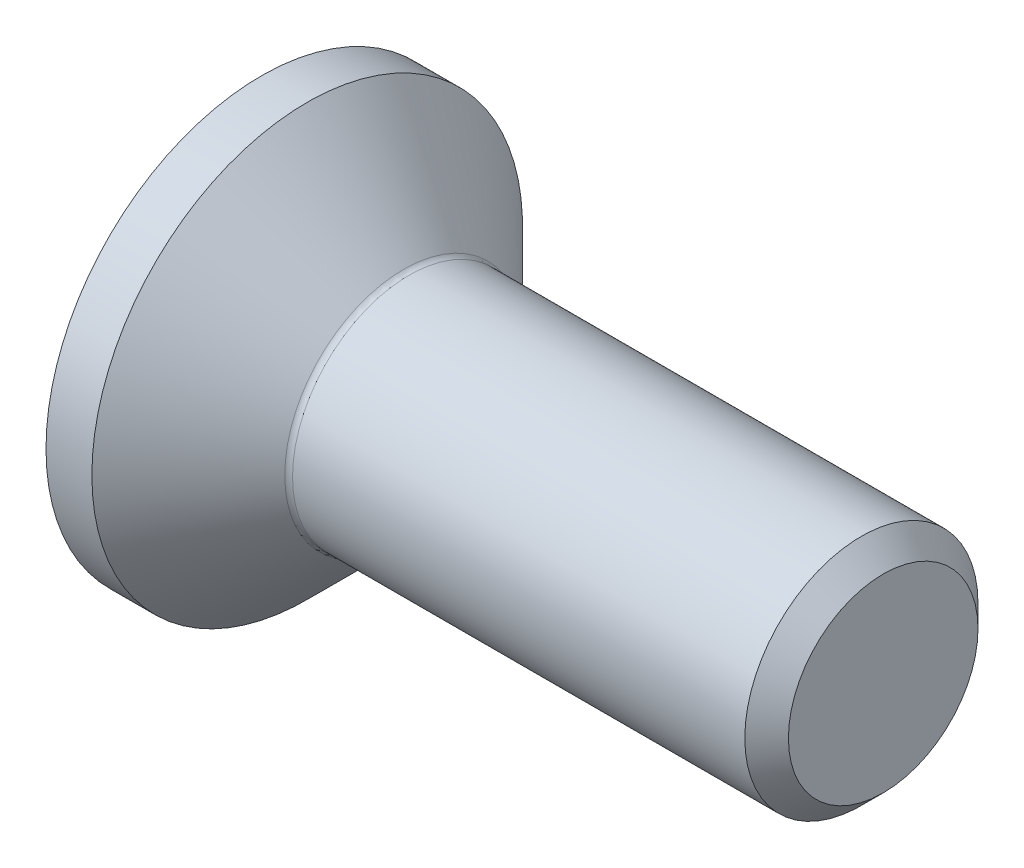
ISO-10303-21;
HEADER;
FILE_DESCRIPTION(('STEP AP214'),'2;1');
FILE_NAME('part.step','',(''),(''),'','','');
FILE_SCHEMA(('AUTOMOTIVE_DESIGN { 1 0 10303 214 1 1 1 1 }'));
ENDSEC;
DATA;
#1=APPLICATION_CONTEXT('core data for automotive mechanical design processes');
#2=APPLICATION_PROTOCOL_DEFINITION('international standard','automotive_design',2000,#1);
#3=PRODUCT_CONTEXT('',#1,'mechanical');
#4=PRODUCT('Part','Part','',(#3));
#5=PRODUCT_RELATED_PRODUCT_CATEGORY('part','',(#4));
#6=PRODUCT_DEFINITION_FORMATION('','',#4);
#7=PRODUCT_DEFINITION_CONTEXT('part definition',#1,'design');
#8=PRODUCT_DEFINITION('design','',#6,#7);
#9=PRODUCT_DEFINITION_SHAPE('','',#8);
#10=(LENGTH_UNIT() NAMED_UNIT(*) SI_UNIT(.MILLI.,.METRE.));
#11=(NAMED_UNIT(*) PLANE_ANGLE_UNIT() SI_UNIT($,.RADIAN.));
#12=(NAMED_UNIT(*) SI_UNIT($,.STERADIAN.) SOLID_ANGLE_UNIT());
#13=UNCERTAINTY_MEASURE_WITH_UNIT(LENGTH_MEASURE(1.E-05),#10,'distance_accuracy_value','');
#14=(GEOMETRIC_REPRESENTATION_CONTEXT(3) GLOBAL_UNCERTAINTY_ASSIGNED_CONTEXT((#13)) GLOBAL_UNIT_ASSIGNED_CONTEXT((#10,
#11,#12)) REPRESENTATION_CONTEXT('',''));
#15=CARTESIAN_POINT('',(0.,0.,0.));
#16=DIRECTION('',(0.,0.,1.));
#17=DIRECTION('',(1.,0.,0.));
#18=AXIS2_PLACEMENT_3D('',#15,#16,#17);
#19=CARTESIAN_POINT('',(0.,0.,0.));
#20=DIRECTION('',(-1.,0.,0.));
#21=DIRECTION('',(0.,0.,1.));
#22=AXIS2_PLACEMENT_3D('',#19,#20,#21);
#23=PLANE('',#22);
#24=CARTESIAN_POINT('',(0.,0.,0.));
#25=DIRECTION('',(-1.,0.,0.));
#26=DIRECTION('',(0.,0.,1.));
#27=AXIS2_PLACEMENT_3D('',#24,#25,#26);
#28=CIRCLE('',#27,2.77);
#29=CARTESIAN_POINT('',(0.,0.,2.77));
#30=VERTEX_POINT('',#29);
#31=EDGE_CURVE('E158',#30,#30,#28,.T.);
#32=ORIENTED_EDGE('',*,*,#31,.T.);
#33=EDGE_LOOP('',(#32));
#34=FACE_BOUND('',#33,.T.);
#35=DIRECTION('',(0.,-0.500000000000005,-0.866025403784435));
#36=VECTOR('',#35,1.);
#37=CARTESIAN_POINT('',(0.,-0.58312377188152,1.01));
#38=LINE('',#37,#36);
#39=CARTESIAN_POINT('',(0.,-0.58312377188152,1.01));
#40=VERTEX_POINT('',#39);
#41=CARTESIAN_POINT('',(0.,-1.16624754376305,0.));
#42=VERTEX_POINT('',#41);
#43=EDGE_CURVE('E120',#40,#42,#38,.T.);
#44=ORIENTED_EDGE('',*,*,#43,.T.);
#45=DIRECTION('',(0.,0.500000000000005,-0.866025403784436));
#46=VECTOR('',#45,1.);
#47=CARTESIAN_POINT('',(0.,-1.16624754376305,0.));
#48=LINE('',#47,#46);
#49=CARTESIAN_POINT('',(0.,-0.583123771881521,-1.01));
#50=VERTEX_POINT('',#49);
#51=EDGE_CURVE('E50',#42,#50,#48,.T.);
#52=ORIENTED_EDGE('',*,*,#51,.T.);
#53=DIRECTION('',(0.,1.,0.));
#54=VECTOR('',#53,1.);
#55=CARTESIAN_POINT('',(0.,-0.583123771881521,-1.01));
#56=LINE('',#55,#54);
#57=CARTESIAN_POINT('',(0.,0.583123771881522,-1.01));
#58=VERTEX_POINT('',#57);
#59=EDGE_CURVE('E135',#50,#58,#56,.T.);
#60=ORIENTED_EDGE('',*,*,#59,.T.);
#61=DIRECTION('',(0.,0.500000000000003,0.866025403784437));
#62=VECTOR('',#61,1.);
#63=CARTESIAN_POINT('',(0.,0.583123771881522,-1.01));
#64=LINE('',#63,#62);
#65=CARTESIAN_POINT('',(0.,1.16624754376305,0.));
#66=VERTEX_POINT('',#65);
#67=EDGE_CURVE('E271',#58,#66,#64,.T.);
#68=ORIENTED_EDGE('',*,*,#67,.T.);
#69=DIRECTION('',(0.,-0.500000000000002,0.866025403784438));
#70=VECTOR('',#69,1.);
#71=CARTESIAN_POINT('',(0.,1.16624754376305,0.));
#72=LINE('',#71,#70);
#73=CARTESIAN_POINT('',(0.,0.583123771881522,1.01));
#74=VERTEX_POINT('',#73);
#75=EDGE_CURVE('E274',#66,#74,#72,.T.);
#76=ORIENTED_EDGE('',*,*,#75,.T.);
#77=DIRECTION('',(0.,-1.,0.));
#78=VECTOR('',#77,1.);
#79=CARTESIAN_POINT('',(0.,0.583123771881522,1.01));
#80=LINE('',#79,#78);
#81=EDGE_CURVE('E277',#74,#40,#80,.T.);
#82=ORIENTED_EDGE('',*,*,#81,.T.);
#83=EDGE_LOOP('',(#44,#52,#60,#68,#76,#82));
#84=FACE_BOUND('',#83,.T.);
#85=ADVANCED_FACE('F35',(#34,#84),#23,.T.);
#86=CARTESIAN_POINT('',(0.,0.,0.));
#87=DIRECTION('',(-1.,0.,0.));
#88=DIRECTION('',(0.,0.,1.));
#89=AXIS2_PLACEMENT_3D('',#86,#87,#88);
#90=CYLINDRICAL_SURFACE('',#89,2.77);
#91=CARTESIAN_POINT('',(0.590000000000013,0.,0.));
#92=DIRECTION('',(-1.,0.,0.));
#93=DIRECTION('',(0.,0.,1.));
#94=AXIS2_PLACEMENT_3D('',#91,#92,#93);
#95=CIRCLE('',#94,2.77);
#96=CARTESIAN_POINT('',(0.590000000000013,0.,2.77));
#97=VERTEX_POINT('',#96);
#98=EDGE_CURVE('E155',#97,#97,#95,.T.);
#99=ORIENTED_EDGE('',*,*,#98,.T.);
#100=EDGE_LOOP('',(#99));
#101=FACE_BOUND('',#100,.T.);
#102=ORIENTED_EDGE('',*,*,#31,.F.);
#103=EDGE_LOOP('',(#102));
#104=FACE_BOUND('',#103,.T.);
#105=ADVANCED_FACE('F179',(#101,#104),#90,.T.);
#106=CARTESIAN_POINT('',(0.590000000000013,0.,0.));
#107=DIRECTION('',(-1.,0.,0.));
#108=DIRECTION('',(0.,0.,1.));
#109=AXIS2_PLACEMENT_3D('',#106,#107,#108);
#110=CONICAL_SURFACE('',#109,2.77,0.785398163397451);
#111=CARTESIAN_POINT('',(1.83071067811866,0.,0.));
#112=DIRECTION('',(-1.,0.,0.));
#113=DIRECTION('',(0.,0.,1.));
#114=AXIS2_PLACEMENT_3D('',#111,#112,#113);
#115=CIRCLE('',#114,1.52928932188135);
#116=CARTESIAN_POINT('',(1.83071067811866,0.,1.52928932188135));
#117=VERTEX_POINT('',#116);
#118=EDGE_CURVE('E43',#117,#117,#115,.T.);
#119=ORIENTED_EDGE('',*,*,#118,.T.);
#120=EDGE_LOOP('',(#119));
#121=FACE_BOUND('',#120,.T.);
#122=ORIENTED_EDGE('',*,*,#98,.F.);
#123=EDGE_LOOP('',(#122));
#124=FACE_BOUND('',#123,.T.);
#125=ADVANCED_FACE('F163',(#121,#124),#110,.T.);
#126=CARTESIAN_POINT('',(0.,0.,0.));
#127=DIRECTION('',(-1.,0.,0.));
#128=DIRECTION('',(0.,0.,1.));
#129=AXIS2_PLACEMENT_3D('',#126,#127,#128);
#130=CYLINDRICAL_SURFACE('',#129,1.5);
#131=CARTESIAN_POINT('',(1.90142135623731,0.,0.));
#132=DIRECTION('',(-1.,0.,0.));
#133=DIRECTION('',(0.,0.,1.));
#134=AXIS2_PLACEMENT_3D('',#131,#132,#133);
#135=CIRCLE('',#134,1.5);
#136=CARTESIAN_POINT('',(1.90142135623731,0.,1.5));
#137=VERTEX_POINT('',#136);
#138=EDGE_CURVE('E11',#137,#137,#135,.F.);
#139=ORIENTED_EDGE('',*,*,#138,.T.);
#140=EDGE_LOOP('',(#139));
#141=FACE_BOUND('',#140,.T.);
#142=CARTESIAN_POINT('',(7.71949999999999,0.,0.));
#143=DIRECTION('',(-1.,0.,0.));
#144=DIRECTION('',(0.,0.,1.));
#145=AXIS2_PLACEMENT_3D('',#142,#143,#144);
#146=CIRCLE('',#145,1.5);
#147=CARTESIAN_POINT('',(7.71949999999999,0.,1.5));
#148=VERTEX_POINT('',#147);
#149=EDGE_CURVE('E152',#148,#148,#146,.T.);
#150=ORIENTED_EDGE('',*,*,#149,.T.);
#151=EDGE_LOOP('',(#150));
#152=FACE_BOUND('',#151,.T.);
#153=ADVANCED_FACE('F190',(#141,#152),#130,.T.);
#154=CARTESIAN_POINT('',(7.99999999999999,0.,0.));
#155=DIRECTION('',(-1.,0.,0.));
#156=DIRECTION('',(0.,0.,1.));
#157=AXIS2_PLACEMENT_3D('',#154,#155,#156);
#158=CONICAL_SURFACE('',#157,1.2195,0.785398163397448);
#159=ORIENTED_EDGE('',*,*,#149,.F.);
#160=EDGE_LOOP('',(#159));
#161=FACE_BOUND('',#160,.T.);
#162=CARTESIAN_POINT('',(7.99999999999999,0.,0.));
#163=DIRECTION('',(-1.,0.,0.));
#164=DIRECTION('',(0.,0.,1.));
#165=AXIS2_PLACEMENT_3D('',#162,#163,#164);
#166=CIRCLE('',#165,1.2195);
#167=CARTESIAN_POINT('',(7.99999999999999,0.,1.2195));
#168=VERTEX_POINT('',#167);
#169=EDGE_CURVE('E148',#168,#168,#166,.T.);
#170=ORIENTED_EDGE('',*,*,#169,.T.);
#171=EDGE_LOOP('',(#170));
#172=FACE_BOUND('',#171,.T.);
#173=ADVANCED_FACE('F174',(#161,#172),#158,.T.);
#174=CARTESIAN_POINT('',(7.99999999999999,1.2195,0.));
#175=DIRECTION('',(1.,0.,0.));
#176=DIRECTION('',(0.,0.,-1.));
#177=AXIS2_PLACEMENT_3D('',#174,#175,#176);
#178=PLANE('',#177);
#179=ORIENTED_EDGE('',*,*,#169,.F.);
#180=EDGE_LOOP('',(#179));
#181=FACE_BOUND('',#180,.T.);
#182=ADVANCED_FACE('F167',(#181),#178,.T.);
#183=CARTESIAN_POINT('',(1.90142135623731,0.,0.));
#184=DIRECTION('',(-1.,0.,0.));
#185=DIRECTION('',(0.,0.,1.));
#186=AXIS2_PLACEMENT_3D('',#183,#184,#185);
#187=TOROIDAL_SURFACE('',#186,1.6,0.1);
#188=ORIENTED_EDGE('',*,*,#138,.F.);
#189=EDGE_LOOP('',(#188));
#190=FACE_BOUND('',#189,.T.);
#191=ORIENTED_EDGE('',*,*,#118,.F.);
#192=EDGE_LOOP('',(#191));
#193=FACE_BOUND('',#192,.T.);
#194=ADVANCED_FACE('F37',(#190,#193),#187,.F.);
#195=CARTESIAN_POINT('',(1.1,-1.16624754376305,0.));
#196=DIRECTION('',(0.,0.866025403784436,0.500000000000005));
#197=DIRECTION('',(0.,-0.500000000000005,0.866025403784436));
#198=AXIS2_PLACEMENT_3D('',#195,#196,#197);
#199=PLANE('',#198);
#200=ORIENTED_EDGE('',*,*,#51,.F.);
#201=DIRECTION('',(-1.,0.,0.));
#202=VECTOR('',#201,1.);
#203=CARTESIAN_POINT('',(1.1,-1.16624754376305,0.));
#204=LINE('',#203,#202);
#205=CARTESIAN_POINT('',(1.1,-1.16624754376305,0.));
#206=VERTEX_POINT('',#205);
#207=EDGE_CURVE('E268',#206,#42,#204,.T.);
#208=ORIENTED_EDGE('',*,*,#207,.F.);
#209=DIRECTION('',(0.,0.500000000000005,-0.866025403784436));
#210=VECTOR('',#209,1.);
#211=CARTESIAN_POINT('',(1.1,-1.16624754376305,0.));
#212=LINE('',#211,#210);
#213=CARTESIAN_POINT('',(1.1,-0.874685657822283,-0.505000000000006));
#214=VERTEX_POINT('',#213);
#215=EDGE_CURVE('E117',#206,#214,#212,.T.);
#216=ORIENTED_EDGE('',*,*,#215,.T.);
#217=CARTESIAN_POINT('',(1.1,-0.583123771881521,-1.01));
#218=VERTEX_POINT('',#217);
#219=EDGE_CURVE('E111',#214,#218,#212,.T.);
#220=ORIENTED_EDGE('',*,*,#219,.T.);
#221=DIRECTION('',(-1.,0.,0.));
#222=VECTOR('',#221,1.);
#223=CARTESIAN_POINT('',(1.1,-0.583123771881521,-1.01));
#224=LINE('',#223,#222);
#225=EDGE_CURVE('E115',#218,#50,#224,.T.);
#226=ORIENTED_EDGE('',*,*,#225,.T.);
#227=EDGE_LOOP('',(#200,#208,#216,#220,#226));
#228=FACE_BOUND('',#227,.T.);
#229=ADVANCED_FACE('F113',(#228),#199,.T.);
#230=CARTESIAN_POINT('',(1.1,-0.583123771881521,-1.01));
#231=DIRECTION('',(0.,0.,1.));
#232=DIRECTION('',(0.,-1.,0.));
#233=AXIS2_PLACEMENT_3D('',#230,#231,#232);
#234=PLANE('',#233);
#235=ORIENTED_EDGE('',*,*,#59,.F.);
#236=ORIENTED_EDGE('',*,*,#225,.F.);
#237=DIRECTION('',(0.,1.,0.));
#238=VECTOR('',#237,1.);
#239=CARTESIAN_POINT('',(1.1,-0.583123771881521,-1.01));
#240=LINE('',#239,#238);
#241=CARTESIAN_POINT('',(1.1,0.,-1.01));
#242=VERTEX_POINT('',#241);
#243=EDGE_CURVE('E123',#218,#242,#240,.T.);
#244=ORIENTED_EDGE('',*,*,#243,.T.);
#245=CARTESIAN_POINT('',(1.1,0.583123771881522,-1.01));
#246=VERTEX_POINT('',#245);
#247=EDGE_CURVE('E130',#242,#246,#240,.T.);
#248=ORIENTED_EDGE('',*,*,#247,.T.);
#249=DIRECTION('',(-1.,0.,0.));
#250=VECTOR('',#249,1.);
#251=CARTESIAN_POINT('',(1.1,0.583123771881522,-1.01));
#252=LINE('',#251,#250);
#253=EDGE_CURVE('E137',#246,#58,#252,.T.);
#254=ORIENTED_EDGE('',*,*,#253,.T.);
#255=EDGE_LOOP('',(#235,#236,#244,#248,#254));
#256=FACE_BOUND('',#255,.T.);
#257=ADVANCED_FACE('F132',(#256),#234,.T.);
#258=CARTESIAN_POINT('',(1.1,0.583123771881522,-1.01));
#259=DIRECTION('',(0.,-0.866025403784437,0.500000000000003));
#260=DIRECTION('',(0.,-0.500000000000003,-0.866025403784437));
#261=AXIS2_PLACEMENT_3D('',#258,#259,#260);
#262=PLANE('',#261);
#263=ORIENTED_EDGE('',*,*,#67,.F.);
#264=ORIENTED_EDGE('',*,*,#253,.F.);
#265=DIRECTION('',(0.,0.500000000000003,0.866025403784437));
#266=VECTOR('',#265,1.);
#267=CARTESIAN_POINT('',(1.1,0.583123771881522,-1.01));
#268=LINE('',#267,#266);
#269=CARTESIAN_POINT('',(1.1,0.874685657822282,-0.505000000000003));
#270=VERTEX_POINT('',#269);
#271=EDGE_CURVE('E260',#246,#270,#268,.T.);
#272=ORIENTED_EDGE('',*,*,#271,.T.);
#273=CARTESIAN_POINT('',(1.1,1.16624754376305,0.));
#274=VERTEX_POINT('',#273);
#275=EDGE_CURVE('E129',#270,#274,#268,.T.);
#276=ORIENTED_EDGE('',*,*,#275,.T.);
#277=DIRECTION('',(-1.,0.,0.));
#278=VECTOR('',#277,1.);
#279=CARTESIAN_POINT('',(1.1,1.16624754376305,0.));
#280=LINE('',#279,#278);
#281=EDGE_CURVE('E143',#274,#66,#280,.T.);
#282=ORIENTED_EDGE('',*,*,#281,.T.);
#283=EDGE_LOOP('',(#263,#264,#272,#276,#282));
#284=FACE_BOUND('',#283,.T.);
#285=ADVANCED_FACE('F204',(#284),#262,.T.);
#286=CARTESIAN_POINT('',(1.1,1.16624754376305,0.));
#287=DIRECTION('',(0.,-0.866025403784438,-0.500000000000002));
#288=DIRECTION('',(0.,0.500000000000002,-0.866025403784438));
#289=AXIS2_PLACEMENT_3D('',#286,#287,#288);
#290=PLANE('',#289);
#291=ORIENTED_EDGE('',*,*,#75,.F.);
#292=ORIENTED_EDGE('',*,*,#281,.F.);
#293=DIRECTION('',(0.,-0.500000000000002,0.866025403784438));
#294=VECTOR('',#293,1.);
#295=CARTESIAN_POINT('',(1.1,1.16624754376305,0.));
#296=LINE('',#295,#294);
#297=CARTESIAN_POINT('',(1.1,0.874685657822282,0.505000000000002));
#298=VERTEX_POINT('',#297);
#299=EDGE_CURVE('E58',#274,#298,#296,.T.);
#300=ORIENTED_EDGE('',*,*,#299,.T.);
#301=CARTESIAN_POINT('',(1.1,0.583123771881522,1.01));
#302=VERTEX_POINT('',#301);
#303=EDGE_CURVE('E239',#298,#302,#296,.T.);
#304=ORIENTED_EDGE('',*,*,#303,.T.);
#305=DIRECTION('',(-1.,0.,0.));
#306=VECTOR('',#305,1.);
#307=CARTESIAN_POINT('',(1.1,0.583123771881522,1.01));
#308=LINE('',#307,#306);
#309=EDGE_CURVE('E253',#302,#74,#308,.T.);
#310=ORIENTED_EDGE('',*,*,#309,.T.);
#311=EDGE_LOOP('',(#291,#292,#300,#304,#310));
#312=FACE_BOUND('',#311,.T.);
#313=ADVANCED_FACE('F207',(#312),#290,.T.);
#314=CARTESIAN_POINT('',(1.1,0.583123771881522,1.01));
#315=DIRECTION('',(0.,0.,-1.));
#316=DIRECTION('',(0.,1.,0.));
#317=AXIS2_PLACEMENT_3D('',#314,#315,#316);
#318=PLANE('',#317);
#319=ORIENTED_EDGE('',*,*,#81,.F.);
#320=ORIENTED_EDGE('',*,*,#309,.F.);
#321=DIRECTION('',(0.,-1.,0.));
#322=VECTOR('',#321,1.);
#323=CARTESIAN_POINT('',(1.1,0.583123771881522,1.01));
#324=LINE('',#323,#322);
#325=CARTESIAN_POINT('',(1.1,0.,1.01));
#326=VERTEX_POINT('',#325);
#327=EDGE_CURVE('E238',#302,#326,#324,.T.);
#328=ORIENTED_EDGE('',*,*,#327,.T.);
#329=CARTESIAN_POINT('',(1.1,-0.58312377188152,1.01));
#330=VERTEX_POINT('',#329);
#331=EDGE_CURVE('E244',#326,#330,#324,.T.);
#332=ORIENTED_EDGE('',*,*,#331,.T.);
#333=DIRECTION('',(-1.,0.,0.));
#334=VECTOR('',#333,1.);
#335=CARTESIAN_POINT('',(1.1,-0.58312377188152,1.01));
#336=LINE('',#335,#334);
#337=EDGE_CURVE('E283',#330,#40,#336,.T.);
#338=ORIENTED_EDGE('',*,*,#337,.T.);
#339=EDGE_LOOP('',(#319,#320,#328,#332,#338));
#340=FACE_BOUND('',#339,.T.);
#341=ADVANCED_FACE('F211',(#340),#318,.T.);
#342=CARTESIAN_POINT('',(1.1,-0.58312377188152,1.01));
#343=DIRECTION('',(0.,0.866025403784435,-0.500000000000005));
#344=DIRECTION('',(0.,0.500000000000005,0.866025403784436));
#345=AXIS2_PLACEMENT_3D('',#342,#343,#344);
#346=PLANE('',#345);
#347=ORIENTED_EDGE('',*,*,#43,.F.);
#348=ORIENTED_EDGE('',*,*,#337,.F.);
#349=DIRECTION('',(0.,-0.500000000000005,-0.866025403784435));
#350=VECTOR('',#349,1.);
#351=CARTESIAN_POINT('',(1.1,-0.58312377188152,1.01));
#352=LINE('',#351,#350);
#353=CARTESIAN_POINT('',(1.1,-0.874685657822282,0.505000000000007));
#354=VERTEX_POINT('',#353);
#355=EDGE_CURVE('E247',#330,#354,#352,.T.);
#356=ORIENTED_EDGE('',*,*,#355,.T.);
#357=EDGE_CURVE('E254',#354,#206,#352,.T.);
#358=ORIENTED_EDGE('',*,*,#357,.T.);
#359=ORIENTED_EDGE('',*,*,#207,.T.);
#360=EDGE_LOOP('',(#347,#348,#356,#358,#359));
#361=FACE_BOUND('',#360,.T.);
#362=ADVANCED_FACE('F214',(#361),#346,.T.);
#363=CARTESIAN_POINT('',(1.1,-1.16624754376305,0.));
#364=DIRECTION('',(-1.,0.,0.));
#365=DIRECTION('',(0.,0.,1.));
#366=AXIS2_PLACEMENT_3D('',#363,#364,#365);
#367=PLANE('',#366);
#368=CARTESIAN_POINT('',(1.1,0.,0.));
#369=DIRECTION('',(-1.,0.,0.));
#370=DIRECTION('',(0.,0.,1.));
#371=AXIS2_PLACEMENT_3D('',#368,#369,#370);
#372=CIRCLE('',#371,1.01);
#373=EDGE_CURVE('E136',#354,#326,#372,.T.);
#374=ORIENTED_EDGE('',*,*,#373,.F.);
#375=ORIENTED_EDGE('',*,*,#355,.F.);
#376=ORIENTED_EDGE('',*,*,#331,.F.);
#377=EDGE_LOOP('',(#374,#375,#376));
#378=FACE_BOUND('',#377,.T.);
#379=ADVANCED_FACE('F218',(#378),#367,.T.);
#380=EDGE_CURVE('E140',#214,#354,#372,.T.);
#381=ORIENTED_EDGE('',*,*,#380,.F.);
#382=ORIENTED_EDGE('',*,*,#215,.F.);
#383=ORIENTED_EDGE('',*,*,#357,.F.);
#384=EDGE_LOOP('',(#381,#382,#383));
#385=FACE_BOUND('',#384,.T.);
#386=ADVANCED_FACE('F221',(#385),#367,.T.);
#387=EDGE_CURVE('E125',#242,#214,#372,.T.);
#388=ORIENTED_EDGE('',*,*,#387,.F.);
#389=ORIENTED_EDGE('',*,*,#243,.F.);
#390=ORIENTED_EDGE('',*,*,#219,.F.);
#391=EDGE_LOOP('',(#388,#389,#390));
#392=FACE_BOUND('',#391,.T.);
#393=ADVANCED_FACE('F124',(#392),#367,.T.);
#394=EDGE_CURVE('E256',#270,#242,#372,.T.);
#395=ORIENTED_EDGE('',*,*,#394,.F.);
#396=ORIENTED_EDGE('',*,*,#271,.F.);
#397=ORIENTED_EDGE('',*,*,#247,.F.);
#398=EDGE_LOOP('',(#395,#396,#397));
#399=FACE_BOUND('',#398,.T.);
#400=ADVANCED_FACE('F233',(#399),#367,.T.);
#401=EDGE_CURVE('E149',#298,#270,#372,.T.);
#402=ORIENTED_EDGE('',*,*,#401,.F.);
#403=ORIENTED_EDGE('',*,*,#299,.F.);
#404=ORIENTED_EDGE('',*,*,#275,.F.);
#405=EDGE_LOOP('',(#402,#403,#404));
#406=FACE_BOUND('',#405,.T.);
#407=ADVANCED_FACE('F228',(#406),#367,.T.);
#408=EDGE_CURVE('E142',#326,#298,#372,.T.);
#409=ORIENTED_EDGE('',*,*,#408,.F.);
#410=ORIENTED_EDGE('',*,*,#327,.F.);
#411=ORIENTED_EDGE('',*,*,#303,.F.);
#412=EDGE_LOOP('',(#409,#410,#411));
#413=FACE_BOUND('',#412,.T.);
#414=ADVANCED_FACE('F199',(#413),#367,.T.);
#415=CARTESIAN_POINT('',(1.1,0.,0.));
#416=DIRECTION('',(-1.,0.,0.));
#417=DIRECTION('',(0.,0.,1.));
#418=AXIS2_PLACEMENT_3D('',#415,#416,#417);
#419=CONICAL_SURFACE('',#418,1.01,1.04719755119659);
#420=CARTESIAN_POINT('',(1.68312377188153,0.,0.));
#421=VERTEX_POINT('',#420);
#422=VERTEX_LOOP('',#421);
#423=FACE_BOUND('',#422,.T.);
#424=ORIENTED_EDGE('',*,*,#408,.T.);
#425=ORIENTED_EDGE('',*,*,#401,.T.);
#426=ORIENTED_EDGE('',*,*,#394,.T.);
#427=ORIENTED_EDGE('',*,*,#387,.T.);
#428=ORIENTED_EDGE('',*,*,#380,.T.);
#429=ORIENTED_EDGE('',*,*,#373,.T.);
#430=EDGE_LOOP('',(#424,#425,#426,#427,#428,#429));
#431=FACE_BOUND('',#430,.T.);
#432=ADVANCED_FACE('F197',(#423,#431),#419,.F.);
#433=CLOSED_SHELL('',(#85,#105,#125,#153,#173,#182,#194,#229,#257,#285,#313,#341,#362,#379,#386,
#393,#400,#407,#414,#432));
#434=MANIFOLD_SOLID_BREP('B2',#433);
#435=ADVANCED_BREP_SHAPE_REPRESENTATION('',(#18,#434),#14);
#436=SHAPE_DEFINITION_REPRESENTATION(#9,#435);
ENDSEC;
END-ISO-10303-21;
